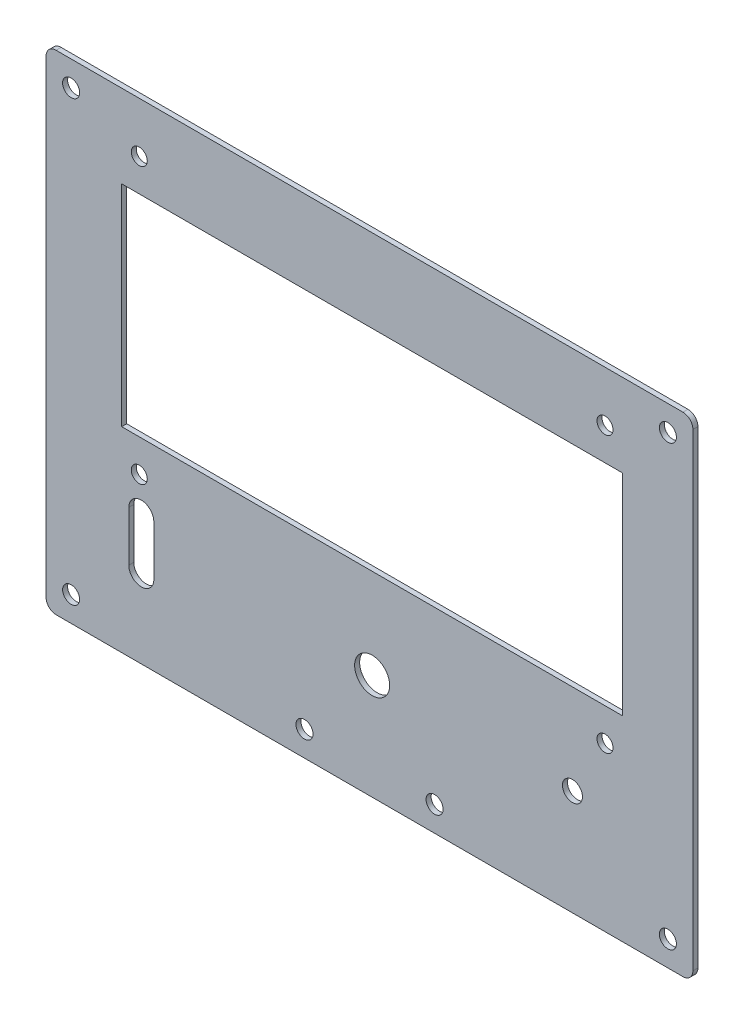
ISO-10303-21;
HEADER;
FILE_DESCRIPTION(('STEP AP214'),'2;1');
FILE_NAME('part.step','',(''),(''),'','','');
FILE_SCHEMA(('AUTOMOTIVE_DESIGN { 1 0 10303 214 1 1 1 1 }'));
ENDSEC;
DATA;
#1=APPLICATION_CONTEXT('core data for automotive mechanical design processes');
#2=APPLICATION_PROTOCOL_DEFINITION('international standard','automotive_design',2000,#1);
#3=PRODUCT_CONTEXT('',#1,'mechanical');
#4=PRODUCT('Part','Part','',(#3));
#5=PRODUCT_RELATED_PRODUCT_CATEGORY('part','',(#4));
#6=PRODUCT_DEFINITION_FORMATION('','',#4);
#7=PRODUCT_DEFINITION_CONTEXT('part definition',#1,'design');
#8=PRODUCT_DEFINITION('design','',#6,#7);
#9=PRODUCT_DEFINITION_SHAPE('','',#8);
#10=(LENGTH_UNIT() NAMED_UNIT(*) SI_UNIT(.MILLI.,.METRE.));
#11=(NAMED_UNIT(*) PLANE_ANGLE_UNIT() SI_UNIT($,.RADIAN.));
#12=(NAMED_UNIT(*) SI_UNIT($,.STERADIAN.) SOLID_ANGLE_UNIT());
#13=UNCERTAINTY_MEASURE_WITH_UNIT(LENGTH_MEASURE(1.E-05),#10,'distance_accuracy_value','');
#14=(GEOMETRIC_REPRESENTATION_CONTEXT(3) GLOBAL_UNCERTAINTY_ASSIGNED_CONTEXT((#13)) GLOBAL_UNIT_ASSIGNED_CONTEXT((#10,
#11,#12)) REPRESENTATION_CONTEXT('',''));
#15=CARTESIAN_POINT('',(0.,0.,0.));
#16=DIRECTION('',(0.,0.,1.));
#17=DIRECTION('',(1.,0.,0.));
#18=AXIS2_PLACEMENT_3D('',#15,#16,#17);
#19=CARTESIAN_POINT('',(110.511379673733,-46.4569942181545,1.));
#20=DIRECTION('',(0.,0.,1.));
#21=DIRECTION('',(1.,0.,0.));
#22=AXIS2_PLACEMENT_3D('',#19,#20,#21);
#23=PLANE('',#22);
#24=CARTESIAN_POINT('',(-11.6516415889526,44.1631832448527,1.));
#25=DIRECTION('',(0.,0.,1.));
#26=DIRECTION('',(1.,0.,0.));
#27=AXIS2_PLACEMENT_3D('',#24,#25,#26);
#28=CIRCLE('',#27,1.69999999999999);
#29=CARTESIAN_POINT('',(-9.95164158895261,44.1631832448527,1.));
#30=VERTEX_POINT('',#29);
#31=EDGE_CURVE('E329',#30,#30,#28,.T.);
#32=ORIENTED_EDGE('',*,*,#31,.F.);
#33=EDGE_LOOP('',(#32));
#34=FACE_BOUND('',#33,.T.);
#35=CARTESIAN_POINT('',(-11.6516415889526,-43.4569942181545,1.));
#36=DIRECTION('',(0.,0.,1.));
#37=DIRECTION('',(1.,0.,0.));
#38=AXIS2_PLACEMENT_3D('',#35,#36,#37);
#39=CIRCLE('',#38,1.69999999999999);
#40=CARTESIAN_POINT('',(-9.95164158895262,-43.4569942181545,1.));
#41=VERTEX_POINT('',#40);
#42=EDGE_CURVE('E319',#41,#41,#39,.T.);
#43=ORIENTED_EDGE('',*,*,#42,.F.);
#44=EDGE_LOOP('',(#43));
#45=FACE_BOUND('',#44,.T.);
#46=CARTESIAN_POINT('',(107.511379673732,-43.4569942181545,1.));
#47=DIRECTION('',(0.,0.,1.));
#48=DIRECTION('',(1.,0.,0.));
#49=AXIS2_PLACEMENT_3D('',#46,#47,#48);
#50=CIRCLE('',#49,1.69999999999999);
#51=CARTESIAN_POINT('',(109.211379673732,-43.4569942181545,1.));
#52=VERTEX_POINT('',#51);
#53=EDGE_CURVE('E316',#52,#52,#50,.T.);
#54=ORIENTED_EDGE('',*,*,#53,.F.);
#55=EDGE_LOOP('',(#54));
#56=FACE_BOUND('',#55,.T.);
#57=CARTESIAN_POINT('',(107.511379673732,44.1631832448527,1.));
#58=DIRECTION('',(0.,0.,1.));
#59=DIRECTION('',(1.,0.,0.));
#60=AXIS2_PLACEMENT_3D('',#57,#58,#59);
#61=CIRCLE('',#60,1.69999999999999);
#62=CARTESIAN_POINT('',(109.211379673732,44.1631832448527,1.));
#63=VERTEX_POINT('',#62);
#64=EDGE_CURVE('E313',#63,#63,#61,.T.);
#65=ORIENTED_EDGE('',*,*,#64,.F.);
#66=EDGE_LOOP('',(#65));
#67=FACE_BOUND('',#66,.T.);
#68=CARTESIAN_POINT('',(34.9492512988797,-43.4569942181544,1.));
#69=DIRECTION('',(0.,0.,1.));
#70=DIRECTION('',(1.,0.,0.));
#71=AXIS2_PLACEMENT_3D('',#68,#69,#70);
#72=CIRCLE('',#71,1.69999999999999);
#73=CARTESIAN_POINT('',(36.6492512988797,-43.4569942181544,1.));
#74=VERTEX_POINT('',#73);
#75=EDGE_CURVE('E309',#74,#74,#72,.T.);
#76=ORIENTED_EDGE('',*,*,#75,.F.);
#77=EDGE_LOOP('',(#76));
#78=FACE_BOUND('',#77,.T.);
#79=CARTESIAN_POINT('',(60.9298690423899,-43.4569942181545,1.));
#80=DIRECTION('',(0.,0.,1.));
#81=DIRECTION('',(1.,0.,0.));
#82=AXIS2_PLACEMENT_3D('',#79,#80,#81);
#83=CIRCLE('',#82,1.69999999999999);
#84=CARTESIAN_POINT('',(62.6298690423899,-43.4569942181545,1.));
#85=VERTEX_POINT('',#84);
#86=EDGE_CURVE('E308',#85,#85,#83,.T.);
#87=ORIENTED_EDGE('',*,*,#86,.F.);
#88=EDGE_LOOP('',(#87));
#89=FACE_BOUND('',#88,.T.);
#90=CARTESIAN_POINT('',(48.4577426044266,-27.384884030655,1.));
#91=DIRECTION('',(0.,0.,1.));
#92=DIRECTION('',(1.,0.,0.));
#93=AXIS2_PLACEMENT_3D('',#90,#91,#92);
#94=CIRCLE('',#93,3.5);
#95=CARTESIAN_POINT('',(51.9577426044266,-27.384884030655,1.));
#96=VERTEX_POINT('',#95);
#97=EDGE_CURVE('E222',#96,#96,#94,.T.);
#98=ORIENTED_EDGE('',*,*,#97,.F.);
#99=EDGE_LOOP('',(#98));
#100=FACE_BOUND('',#99,.T.);
#101=CARTESIAN_POINT('',(94.9614389126352,39.1204020875359,1.));
#102=DIRECTION('',(0.,0.,1.));
#103=DIRECTION('',(1.,0.,0.));
#104=AXIS2_PLACEMENT_3D('',#101,#102,#103);
#105=CIRCLE('',#104,1.60012718479857);
#106=CARTESIAN_POINT('',(96.5615660974338,39.1204020875359,1.));
#107=VERTEX_POINT('',#106);
#108=EDGE_CURVE('E234',#107,#107,#105,.T.);
#109=ORIENTED_EDGE('',*,*,#108,.F.);
#110=EDGE_LOOP('',(#109));
#111=FACE_BOUND('',#110,.T.);
#112=CARTESIAN_POINT('',(1.95404629621795,-15.8839698899152,1.));
#113=DIRECTION('',(0.,0.,1.));
#114=DIRECTION('',(1.,0.,0.));
#115=AXIS2_PLACEMENT_3D('',#112,#113,#114);
#116=CIRCLE('',#115,1.60012718479858);
#117=CARTESIAN_POINT('',(3.55417348101653,-15.8839698899152,1.));
#118=VERTEX_POINT('',#117);
#119=EDGE_CURVE('E246',#118,#118,#116,.T.);
#120=ORIENTED_EDGE('',*,*,#119,.F.);
#121=EDGE_LOOP('',(#120));
#122=FACE_BOUND('',#121,.T.);
#123=CARTESIAN_POINT('',(110.511379673733,-46.4569942181545,1.));
#124=DIRECTION('',(0.,0.,1.));
#125=DIRECTION('',(1.,0.,0.));
#126=AXIS2_PLACEMENT_3D('',#123,#124,#125);
#127=CIRCLE('',#126,1.99999999999999);
#128=CARTESIAN_POINT('',(110.511379673733,-48.4569942181545,1.));
#129=VERTEX_POINT('',#128);
#130=CARTESIAN_POINT('',(112.511379673732,-46.4569942181545,1.));
#131=VERTEX_POINT('',#130);
#132=EDGE_CURVE('E252',#129,#131,#127,.T.);
#133=ORIENTED_EDGE('',*,*,#132,.T.);
#134=DIRECTION('',(0.,1.,0.));
#135=VECTOR('',#134,1.);
#136=CARTESIAN_POINT('',(112.511379673732,47.1631832448527,1.));
#137=LINE('',#136,#135);
#138=CARTESIAN_POINT('',(112.511379673732,47.1631832448527,1.));
#139=VERTEX_POINT('',#138);
#140=EDGE_CURVE('E255',#131,#139,#137,.T.);
#141=ORIENTED_EDGE('',*,*,#140,.T.);
#142=CARTESIAN_POINT('',(110.511379673732,47.1631832448527,1.));
#143=DIRECTION('',(0.,0.,1.));
#144=DIRECTION('',(-1.,0.,0.));
#145=AXIS2_PLACEMENT_3D('',#142,#143,#144);
#146=CIRCLE('',#145,1.99999999999999);
#147=CARTESIAN_POINT('',(110.511379673732,49.1631832448527,1.));
#148=VERTEX_POINT('',#147);
#149=EDGE_CURVE('E258',#139,#148,#146,.T.);
#150=ORIENTED_EDGE('',*,*,#149,.T.);
#151=DIRECTION('',(-1.,0.,0.));
#152=VECTOR('',#151,1.);
#153=CARTESIAN_POINT('',(-14.6516415889526,49.1631832448527,1.));
#154=LINE('',#153,#152);
#155=CARTESIAN_POINT('',(-14.6516415889526,49.1631832448527,1.));
#156=VERTEX_POINT('',#155);
#157=EDGE_CURVE('E260',#148,#156,#154,.T.);
#158=ORIENTED_EDGE('',*,*,#157,.T.);
#159=CARTESIAN_POINT('',(-14.6516415889526,47.1631832448527,1.));
#160=DIRECTION('',(0.,0.,1.));
#161=DIRECTION('',(1.,0.,0.));
#162=AXIS2_PLACEMENT_3D('',#159,#160,#161);
#163=CIRCLE('',#162,2.);
#164=CARTESIAN_POINT('',(-16.6516415889526,47.1631832448527,1.));
#165=VERTEX_POINT('',#164);
#166=EDGE_CURVE('E262',#156,#165,#163,.T.);
#167=ORIENTED_EDGE('',*,*,#166,.T.);
#168=DIRECTION('',(0.,-1.,0.));
#169=VECTOR('',#168,1.);
#170=CARTESIAN_POINT('',(-16.6516415889526,47.1631832448527,1.));
#171=LINE('',#170,#169);
#172=CARTESIAN_POINT('',(-16.6516415889526,-46.4569942181545,1.));
#173=VERTEX_POINT('',#172);
#174=EDGE_CURVE('E264',#165,#173,#171,.T.);
#175=ORIENTED_EDGE('',*,*,#174,.T.);
#176=CARTESIAN_POINT('',(-14.6516415889526,-46.4569942181545,1.));
#177=DIRECTION('',(0.,0.,1.));
#178=DIRECTION('',(1.,0.,0.));
#179=AXIS2_PLACEMENT_3D('',#176,#177,#178);
#180=CIRCLE('',#179,2.);
#181=CARTESIAN_POINT('',(-14.6516415889526,-48.4569942181545,1.));
#182=VERTEX_POINT('',#181);
#183=EDGE_CURVE('E266',#173,#182,#180,.T.);
#184=ORIENTED_EDGE('',*,*,#183,.T.);
#185=DIRECTION('',(1.,0.,0.));
#186=VECTOR('',#185,1.);
#187=CARTESIAN_POINT('',(-14.6516415889526,-48.4569942181545,1.));
#188=LINE('',#187,#186);
#189=EDGE_CURVE('E268',#182,#129,#188,.T.);
#190=ORIENTED_EDGE('',*,*,#189,.T.);
#191=EDGE_LOOP('',(#133,#141,#150,#158,#167,#175,#184,#190));
#192=FACE_BOUND('',#191,.T.);
#193=CARTESIAN_POINT('',(1.95404629621795,39.1204020875359,1.));
#194=DIRECTION('',(0.,0.,1.));
#195=DIRECTION('',(1.,0.,0.));
#196=AXIS2_PLACEMENT_3D('',#193,#194,#195);
#197=CIRCLE('',#196,1.60012718479858);
#198=CARTESIAN_POINT('',(3.55417348101653,39.1204020875359,1.));
#199=VERTEX_POINT('',#198);
#200=EDGE_CURVE('E240',#199,#199,#197,.T.);
#201=ORIENTED_EDGE('',*,*,#200,.F.);
#202=EDGE_LOOP('',(#201));
#203=FACE_BOUND('',#202,.T.);
#204=CARTESIAN_POINT('',(94.9614389126352,-15.8839698899152,1.));
#205=DIRECTION('',(0.,0.,1.));
#206=DIRECTION('',(1.,0.,0.));
#207=AXIS2_PLACEMENT_3D('',#204,#205,#206);
#208=CIRCLE('',#207,1.60012718479857);
#209=CARTESIAN_POINT('',(96.5615660974338,-15.8839698899152,1.));
#210=VERTEX_POINT('',#209);
#211=EDGE_CURVE('E228',#210,#210,#208,.T.);
#212=ORIENTED_EDGE('',*,*,#211,.F.);
#213=EDGE_LOOP('',(#212));
#214=FACE_BOUND('',#213,.T.);
#215=CARTESIAN_POINT('',(88.460922224391,-27.384884030655,1.));
#216=DIRECTION('',(0.,0.,1.));
#217=DIRECTION('',(1.,0.,0.));
#218=AXIS2_PLACEMENT_3D('',#215,#216,#217);
#219=CIRCLE('',#218,2.);
#220=CARTESIAN_POINT('',(90.460922224391,-27.384884030655,1.));
#221=VERTEX_POINT('',#220);
#222=EDGE_CURVE('E216',#221,#221,#219,.T.);
#223=ORIENTED_EDGE('',*,*,#222,.F.);
#224=EDGE_LOOP('',(#223));
#225=FACE_BOUND('',#224,.T.);
#226=DIRECTION('',(0.,1.,0.));
#227=VECTOR('',#226,1.);
#228=CARTESIAN_POINT('',(4.86440845486467,-32.6276637045219,1.));
#229=LINE('',#228,#227);
#230=CARTESIAN_POINT('',(4.86440845486467,-32.6276637045219,1.));
#231=VERTEX_POINT('',#230);
#232=CARTESIAN_POINT('',(4.86440845486467,-22.6276637045219,1.));
#233=VERTEX_POINT('',#232);
#234=EDGE_CURVE('E187',#231,#233,#229,.T.);
#235=ORIENTED_EDGE('',*,*,#234,.F.);
#236=CARTESIAN_POINT('',(2.36440845486467,-32.6276637045219,1.));
#237=DIRECTION('',(0.,0.,1.));
#238=DIRECTION('',(1.,0.,0.));
#239=AXIS2_PLACEMENT_3D('',#236,#237,#238);
#240=CIRCLE('',#239,2.5);
#241=CARTESIAN_POINT('',(-0.135591545135326,-32.6276637045219,1.));
#242=VERTEX_POINT('',#241);
#243=EDGE_CURVE('E185',#242,#231,#240,.T.);
#244=ORIENTED_EDGE('',*,*,#243,.F.);
#245=DIRECTION('',(0.,-1.,0.));
#246=VECTOR('',#245,1.);
#247=CARTESIAN_POINT('',(-0.135591545135326,-32.6276637045219,1.));
#248=LINE('',#247,#246);
#249=CARTESIAN_POINT('',(-0.13559154513533,-22.6276637045219,1.));
#250=VERTEX_POINT('',#249);
#251=EDGE_CURVE('E193',#250,#242,#248,.T.);
#252=ORIENTED_EDGE('',*,*,#251,.F.);
#253=CARTESIAN_POINT('',(2.36440845486467,-22.6276637045219,1.));
#254=DIRECTION('',(0.,0.,1.));
#255=DIRECTION('',(1.,0.,0.));
#256=AXIS2_PLACEMENT_3D('',#253,#254,#255);
#257=CIRCLE('',#256,2.5);
#258=EDGE_CURVE('E190',#233,#250,#257,.T.);
#259=ORIENTED_EDGE('',*,*,#258,.F.);
#260=EDGE_LOOP('',(#235,#244,#252,#259));
#261=FACE_BOUND('',#260,.T.);
#262=DIRECTION('',(0.,1.,0.));
#263=VECTOR('',#262,1.);
#264=CARTESIAN_POINT('',(98.4540462962179,32.6204020875359,1.));
#265=LINE('',#264,#263);
#266=CARTESIAN_POINT('',(98.4540462962179,-9.37959791246413,1.));
#267=VERTEX_POINT('',#266);
#268=CARTESIAN_POINT('',(98.4540462962179,32.6204020875359,1.));
#269=VERTEX_POINT('',#268);
#270=EDGE_CURVE('E155',#267,#269,#265,.T.);
#271=ORIENTED_EDGE('',*,*,#270,.F.);
#272=DIRECTION('',(1.,0.,0.));
#273=VECTOR('',#272,1.);
#274=CARTESIAN_POINT('',(98.4540462962179,-9.37959791246413,1.));
#275=LINE('',#274,#273);
#276=CARTESIAN_POINT('',(-1.54595370378205,-9.37959791246413,1.));
#277=VERTEX_POINT('',#276);
#278=EDGE_CURVE('E147',#277,#267,#275,.T.);
#279=ORIENTED_EDGE('',*,*,#278,.F.);
#280=DIRECTION('',(0.,-1.,0.));
#281=VECTOR('',#280,1.);
#282=CARTESIAN_POINT('',(-1.54595370378205,-9.37959791246413,1.));
#283=LINE('',#282,#281);
#284=CARTESIAN_POINT('',(-1.54595370378205,32.6204020875359,1.));
#285=VERTEX_POINT('',#284);
#286=EDGE_CURVE('E169',#285,#277,#283,.T.);
#287=ORIENTED_EDGE('',*,*,#286,.F.);
#288=DIRECTION('',(-1.,0.,0.));
#289=VECTOR('',#288,1.);
#290=CARTESIAN_POINT('',(-1.54595370378205,32.6204020875359,1.));
#291=LINE('',#290,#289);
#292=EDGE_CURVE('E167',#269,#285,#291,.T.);
#293=ORIENTED_EDGE('',*,*,#292,.F.);
#294=EDGE_LOOP('',(#271,#279,#287,#293));
#295=FACE_BOUND('',#294,.T.);
#296=ADVANCED_FACE('F32',(#34,#45,#56,#67,#78,#89,#100,#111,#122,#192,#203,#214,#225,#261,#295),
#23,.T.);
#297=CARTESIAN_POINT('',(110.511379673733,-46.4569942181545,0.));
#298=DIRECTION('',(0.,0.,1.));
#299=DIRECTION('',(1.,0.,0.));
#300=AXIS2_PLACEMENT_3D('',#297,#298,#299);
#301=PLANE('',#300);
#302=CARTESIAN_POINT('',(-11.6516415889526,44.1631832448527,0.));
#303=DIRECTION('',(0.,0.,1.));
#304=DIRECTION('',(1.,0.,0.));
#305=AXIS2_PLACEMENT_3D('',#302,#303,#304);
#306=CIRCLE('',#305,1.69999999999999);
#307=CARTESIAN_POINT('',(-9.95164158895261,44.1631832448527,0.));
#308=VERTEX_POINT('',#307);
#309=EDGE_CURVE('E36',#308,#308,#306,.T.);
#310=ORIENTED_EDGE('',*,*,#309,.T.);
#311=EDGE_LOOP('',(#310));
#312=FACE_BOUND('',#311,.T.);
#313=CARTESIAN_POINT('',(-11.6516415889526,-43.4569942181545,0.));
#314=DIRECTION('',(0.,0.,1.));
#315=DIRECTION('',(1.,0.,0.));
#316=AXIS2_PLACEMENT_3D('',#313,#314,#315);
#317=CIRCLE('',#316,1.69999999999999);
#318=CARTESIAN_POINT('',(-9.95164158895262,-43.4569942181545,0.));
#319=VERTEX_POINT('',#318);
#320=EDGE_CURVE('E317',#319,#319,#317,.T.);
#321=ORIENTED_EDGE('',*,*,#320,.T.);
#322=EDGE_LOOP('',(#321));
#323=FACE_BOUND('',#322,.T.);
#324=CARTESIAN_POINT('',(107.511379673732,-43.4569942181545,0.));
#325=DIRECTION('',(0.,0.,1.));
#326=DIRECTION('',(1.,0.,0.));
#327=AXIS2_PLACEMENT_3D('',#324,#325,#326);
#328=CIRCLE('',#327,1.69999999999999);
#329=CARTESIAN_POINT('',(109.211379673732,-43.4569942181545,0.));
#330=VERTEX_POINT('',#329);
#331=EDGE_CURVE('E314',#330,#330,#328,.T.);
#332=ORIENTED_EDGE('',*,*,#331,.T.);
#333=EDGE_LOOP('',(#332));
#334=FACE_BOUND('',#333,.T.);
#335=CARTESIAN_POINT('',(107.511379673732,44.1631832448527,0.));
#336=DIRECTION('',(0.,0.,1.));
#337=DIRECTION('',(1.,0.,0.));
#338=AXIS2_PLACEMENT_3D('',#335,#336,#337);
#339=CIRCLE('',#338,1.69999999999999);
#340=CARTESIAN_POINT('',(109.211379673732,44.1631832448527,0.));
#341=VERTEX_POINT('',#340);
#342=EDGE_CURVE('E310',#341,#341,#339,.T.);
#343=ORIENTED_EDGE('',*,*,#342,.T.);
#344=EDGE_LOOP('',(#343));
#345=FACE_BOUND('',#344,.T.);
#346=CARTESIAN_POINT('',(34.9492512988797,-43.4569942181544,0.));
#347=DIRECTION('',(0.,0.,1.));
#348=DIRECTION('',(1.,0.,0.));
#349=AXIS2_PLACEMENT_3D('',#346,#347,#348);
#350=CIRCLE('',#349,1.69999999999999);
#351=CARTESIAN_POINT('',(36.6492512988797,-43.4569942181544,0.));
#352=VERTEX_POINT('',#351);
#353=EDGE_CURVE('E305',#352,#352,#350,.T.);
#354=ORIENTED_EDGE('',*,*,#353,.T.);
#355=EDGE_LOOP('',(#354));
#356=FACE_BOUND('',#355,.T.);
#357=CARTESIAN_POINT('',(60.9298690423899,-43.4569942181545,0.));
#358=DIRECTION('',(0.,0.,1.));
#359=DIRECTION('',(1.,0.,0.));
#360=AXIS2_PLACEMENT_3D('',#357,#358,#359);
#361=CIRCLE('',#360,1.69999999999999);
#362=CARTESIAN_POINT('',(62.6298690423899,-43.4569942181545,0.));
#363=VERTEX_POINT('',#362);
#364=EDGE_CURVE('E175',#363,#363,#361,.T.);
#365=ORIENTED_EDGE('',*,*,#364,.T.);
#366=EDGE_LOOP('',(#365));
#367=FACE_BOUND('',#366,.T.);
#368=CARTESIAN_POINT('',(2.36440845486467,-32.6276637045219,0.));
#369=DIRECTION('',(0.,0.,1.));
#370=DIRECTION('',(1.,0.,0.));
#371=AXIS2_PLACEMENT_3D('',#368,#369,#370);
#372=CIRCLE('',#371,2.5);
#373=CARTESIAN_POINT('',(-0.13559154513533,-32.6276637045219,0.));
#374=VERTEX_POINT('',#373);
#375=CARTESIAN_POINT('',(4.86440845486467,-32.6276637045219,0.));
#376=VERTEX_POINT('',#375);
#377=EDGE_CURVE('E163',#374,#376,#372,.T.);
#378=ORIENTED_EDGE('',*,*,#377,.T.);
#379=DIRECTION('',(0.,1.,0.));
#380=VECTOR('',#379,1.);
#381=CARTESIAN_POINT('',(4.86440845486467,-32.6276637045219,0.));
#382=LINE('',#381,#380);
#383=CARTESIAN_POINT('',(4.86440845486467,-22.6276637045219,0.));
#384=VERTEX_POINT('',#383);
#385=EDGE_CURVE('E198',#376,#384,#382,.T.);
#386=ORIENTED_EDGE('',*,*,#385,.T.);
#387=CARTESIAN_POINT('',(2.36440845486467,-22.6276637045219,0.));
#388=DIRECTION('',(0.,0.,1.));
#389=DIRECTION('',(1.,0.,0.));
#390=AXIS2_PLACEMENT_3D('',#387,#388,#389);
#391=CIRCLE('',#390,2.5);
#392=CARTESIAN_POINT('',(-0.135591545135326,-22.6276637045219,0.));
#393=VERTEX_POINT('',#392);
#394=EDGE_CURVE('E201',#384,#393,#391,.T.);
#395=ORIENTED_EDGE('',*,*,#394,.T.);
#396=DIRECTION('',(0.,-1.,0.));
#397=VECTOR('',#396,1.);
#398=CARTESIAN_POINT('',(-0.135591545135326,-32.6276637045219,0.));
#399=LINE('',#398,#397);
#400=EDGE_CURVE('E188',#393,#374,#399,.T.);
#401=ORIENTED_EDGE('',*,*,#400,.T.);
#402=EDGE_LOOP('',(#378,#386,#395,#401));
#403=FACE_BOUND('',#402,.T.);
#404=CARTESIAN_POINT('',(110.511379673733,-46.4569942181545,0.));
#405=DIRECTION('',(0.,0.,1.));
#406=DIRECTION('',(1.,0.,0.));
#407=AXIS2_PLACEMENT_3D('',#404,#405,#406);
#408=CIRCLE('',#407,1.99999999999999);
#409=CARTESIAN_POINT('',(110.511379673733,-48.4569942181545,0.));
#410=VERTEX_POINT('',#409);
#411=CARTESIAN_POINT('',(112.511379673732,-46.4569942181545,0.));
#412=VERTEX_POINT('',#411);
#413=EDGE_CURVE('E249',#410,#412,#408,.T.);
#414=ORIENTED_EDGE('',*,*,#413,.F.);
#415=DIRECTION('',(1.,0.,0.));
#416=VECTOR('',#415,1.);
#417=CARTESIAN_POINT('',(-14.6516415889526,-48.4569942181545,0.));
#418=LINE('',#417,#416);
#419=CARTESIAN_POINT('',(-14.6516415889526,-48.4569942181545,0.));
#420=VERTEX_POINT('',#419);
#421=EDGE_CURVE('E256',#420,#410,#418,.T.);
#422=ORIENTED_EDGE('',*,*,#421,.F.);
#423=CARTESIAN_POINT('',(-14.6516415889526,-46.4569942181545,0.));
#424=DIRECTION('',(0.,0.,1.));
#425=DIRECTION('',(1.,0.,0.));
#426=AXIS2_PLACEMENT_3D('',#423,#424,#425);
#427=CIRCLE('',#426,2.);
#428=CARTESIAN_POINT('',(-16.6516415889526,-46.4569942181545,0.));
#429=VERTEX_POINT('',#428);
#430=EDGE_CURVE('E283',#429,#420,#427,.T.);
#431=ORIENTED_EDGE('',*,*,#430,.F.);
#432=DIRECTION('',(0.,-1.,0.));
#433=VECTOR('',#432,1.);
#434=CARTESIAN_POINT('',(-16.6516415889526,47.1631832448527,0.));
#435=LINE('',#434,#433);
#436=CARTESIAN_POINT('',(-16.6516415889526,47.1631832448527,0.));
#437=VERTEX_POINT('',#436);
#438=EDGE_CURVE('E281',#437,#429,#435,.T.);
#439=ORIENTED_EDGE('',*,*,#438,.F.);
#440=CARTESIAN_POINT('',(-14.6516415889526,47.1631832448527,0.));
#441=DIRECTION('',(0.,0.,1.));
#442=DIRECTION('',(1.,0.,0.));
#443=AXIS2_PLACEMENT_3D('',#440,#441,#442);
#444=CIRCLE('',#443,2.);
#445=CARTESIAN_POINT('',(-14.6516415889526,49.1631832448527,0.));
#446=VERTEX_POINT('',#445);
#447=EDGE_CURVE('E279',#446,#437,#444,.T.);
#448=ORIENTED_EDGE('',*,*,#447,.F.);
#449=DIRECTION('',(-1.,0.,0.));
#450=VECTOR('',#449,1.);
#451=CARTESIAN_POINT('',(-14.6516415889526,49.1631832448527,0.));
#452=LINE('',#451,#450);
#453=CARTESIAN_POINT('',(110.511379673732,49.1631832448527,0.));
#454=VERTEX_POINT('',#453);
#455=EDGE_CURVE('E277',#454,#446,#452,.T.);
#456=ORIENTED_EDGE('',*,*,#455,.F.);
#457=CARTESIAN_POINT('',(110.511379673732,47.1631832448527,0.));
#458=DIRECTION('',(0.,0.,1.));
#459=DIRECTION('',(-1.,0.,0.));
#460=AXIS2_PLACEMENT_3D('',#457,#458,#459);
#461=CIRCLE('',#460,1.99999999999999);
#462=CARTESIAN_POINT('',(112.511379673732,47.1631832448527,0.));
#463=VERTEX_POINT('',#462);
#464=EDGE_CURVE('E275',#463,#454,#461,.T.);
#465=ORIENTED_EDGE('',*,*,#464,.F.);
#466=DIRECTION('',(0.,1.,0.));
#467=VECTOR('',#466,1.);
#468=CARTESIAN_POINT('',(112.511379673732,47.1631832448527,0.));
#469=LINE('',#468,#467);
#470=EDGE_CURVE('E273',#412,#463,#469,.T.);
#471=ORIENTED_EDGE('',*,*,#470,.F.);
#472=EDGE_LOOP('',(#414,#422,#431,#439,#448,#456,#465,#471));
#473=FACE_BOUND('',#472,.T.);
#474=CARTESIAN_POINT('',(1.95404629621795,-15.8839698899152,0.));
#475=DIRECTION('',(0.,0.,1.));
#476=DIRECTION('',(1.,0.,0.));
#477=AXIS2_PLACEMENT_3D('',#474,#475,#476);
#478=CIRCLE('',#477,1.60012718479858);
#479=CARTESIAN_POINT('',(3.55417348101653,-15.8839698899152,0.));
#480=VERTEX_POINT('',#479);
#481=EDGE_CURVE('E243',#480,#480,#478,.T.);
#482=ORIENTED_EDGE('',*,*,#481,.T.);
#483=EDGE_LOOP('',(#482));
#484=FACE_BOUND('',#483,.T.);
#485=CARTESIAN_POINT('',(1.95404629621795,39.1204020875359,0.));
#486=DIRECTION('',(0.,0.,1.));
#487=DIRECTION('',(1.,0.,0.));
#488=AXIS2_PLACEMENT_3D('',#485,#486,#487);
#489=CIRCLE('',#488,1.60012718479858);
#490=CARTESIAN_POINT('',(3.55417348101653,39.1204020875359,0.));
#491=VERTEX_POINT('',#490);
#492=EDGE_CURVE('E237',#491,#491,#489,.T.);
#493=ORIENTED_EDGE('',*,*,#492,.T.);
#494=EDGE_LOOP('',(#493));
#495=FACE_BOUND('',#494,.T.);
#496=CARTESIAN_POINT('',(94.9614389126352,39.1204020875359,0.));
#497=DIRECTION('',(0.,0.,1.));
#498=DIRECTION('',(1.,0.,0.));
#499=AXIS2_PLACEMENT_3D('',#496,#497,#498);
#500=CIRCLE('',#499,1.60012718479857);
#501=CARTESIAN_POINT('',(96.5615660974338,39.1204020875359,0.));
#502=VERTEX_POINT('',#501);
#503=EDGE_CURVE('E231',#502,#502,#500,.T.);
#504=ORIENTED_EDGE('',*,*,#503,.T.);
#505=EDGE_LOOP('',(#504));
#506=FACE_BOUND('',#505,.T.);
#507=CARTESIAN_POINT('',(94.9614389126352,-15.8839698899152,0.));
#508=DIRECTION('',(0.,0.,1.));
#509=DIRECTION('',(1.,0.,0.));
#510=AXIS2_PLACEMENT_3D('',#507,#508,#509);
#511=CIRCLE('',#510,1.60012718479857);
#512=CARTESIAN_POINT('',(96.5615660974338,-15.8839698899152,0.));
#513=VERTEX_POINT('',#512);
#514=EDGE_CURVE('E225',#513,#513,#511,.T.);
#515=ORIENTED_EDGE('',*,*,#514,.T.);
#516=EDGE_LOOP('',(#515));
#517=FACE_BOUND('',#516,.T.);
#518=CARTESIAN_POINT('',(48.4577426044266,-27.384884030655,0.));
#519=DIRECTION('',(0.,0.,1.));
#520=DIRECTION('',(1.,0.,0.));
#521=AXIS2_PLACEMENT_3D('',#518,#519,#520);
#522=CIRCLE('',#521,3.5);
#523=CARTESIAN_POINT('',(51.9577426044266,-27.384884030655,0.));
#524=VERTEX_POINT('',#523);
#525=EDGE_CURVE('E219',#524,#524,#522,.T.);
#526=ORIENTED_EDGE('',*,*,#525,.T.);
#527=EDGE_LOOP('',(#526));
#528=FACE_BOUND('',#527,.T.);
#529=CARTESIAN_POINT('',(88.460922224391,-27.384884030655,0.));
#530=DIRECTION('',(0.,0.,1.));
#531=DIRECTION('',(1.,0.,0.));
#532=AXIS2_PLACEMENT_3D('',#529,#530,#531);
#533=CIRCLE('',#532,2.);
#534=CARTESIAN_POINT('',(90.460922224391,-27.384884030655,0.));
#535=VERTEX_POINT('',#534);
#536=EDGE_CURVE('E215',#535,#535,#533,.T.);
#537=ORIENTED_EDGE('',*,*,#536,.T.);
#538=EDGE_LOOP('',(#537));
#539=FACE_BOUND('',#538,.T.);
#540=DIRECTION('',(1.,0.,0.));
#541=VECTOR('',#540,1.);
#542=CARTESIAN_POINT('',(98.4540462962179,-9.37959791246413,0.));
#543=LINE('',#542,#541);
#544=CARTESIAN_POINT('',(-1.54595370378205,-9.37959791246413,0.));
#545=VERTEX_POINT('',#544);
#546=CARTESIAN_POINT('',(98.4540462962179,-9.37959791246413,0.));
#547=VERTEX_POINT('',#546);
#548=EDGE_CURVE('E57',#545,#547,#543,.T.);
#549=ORIENTED_EDGE('',*,*,#548,.T.);
#550=DIRECTION('',(0.,1.,0.));
#551=VECTOR('',#550,1.);
#552=CARTESIAN_POINT('',(98.4540462962179,32.6204020875359,0.));
#553=LINE('',#552,#551);
#554=CARTESIAN_POINT('',(98.4540462962179,32.6204020875359,0.));
#555=VERTEX_POINT('',#554);
#556=EDGE_CURVE('E162',#547,#555,#553,.T.);
#557=ORIENTED_EDGE('',*,*,#556,.T.);
#558=DIRECTION('',(-1.,0.,0.));
#559=VECTOR('',#558,1.);
#560=CARTESIAN_POINT('',(-1.54595370378205,32.6204020875359,0.));
#561=LINE('',#560,#559);
#562=CARTESIAN_POINT('',(-1.54595370378205,32.6204020875359,0.));
#563=VERTEX_POINT('',#562);
#564=EDGE_CURVE('E177',#555,#563,#561,.T.);
#565=ORIENTED_EDGE('',*,*,#564,.T.);
#566=DIRECTION('',(0.,-1.,0.));
#567=VECTOR('',#566,1.);
#568=CARTESIAN_POINT('',(-1.54595370378205,-9.37959791246413,0.));
#569=LINE('',#568,#567);
#570=EDGE_CURVE('E156',#563,#545,#569,.T.);
#571=ORIENTED_EDGE('',*,*,#570,.T.);
#572=EDGE_LOOP('',(#549,#557,#565,#571));
#573=FACE_BOUND('',#572,.T.);
#574=ADVANCED_FACE('F340',(#312,#323,#334,#345,#356,#367,#403,#473,#484,#495,#506,#517,#528,
#539,#573),#301,.F.);
#575=CARTESIAN_POINT('',(110.511379673733,-46.4569942181545,1.));
#576=DIRECTION('',(0.,0.,-1.));
#577=DIRECTION('',(-1.,0.,0.));
#578=AXIS2_PLACEMENT_3D('',#575,#576,#577);
#579=CYLINDRICAL_SURFACE('',#578,1.99999999999999);
#580=ORIENTED_EDGE('',*,*,#413,.T.);
#581=DIRECTION('',(0.,0.,-1.));
#582=VECTOR('',#581,1.);
#583=CARTESIAN_POINT('',(112.511379673732,-46.4569942181545,1.));
#584=LINE('',#583,#582);
#585=EDGE_CURVE('E11',#131,#412,#584,.T.);
#586=ORIENTED_EDGE('',*,*,#585,.F.);
#587=ORIENTED_EDGE('',*,*,#132,.F.);
#588=DIRECTION('',(0.,0.,-1.));
#589=VECTOR('',#588,1.);
#590=CARTESIAN_POINT('',(110.511379673733,-48.4569942181545,1.));
#591=LINE('',#590,#589);
#592=EDGE_CURVE('E270',#129,#410,#591,.T.);
#593=ORIENTED_EDGE('',*,*,#592,.T.);
#594=EDGE_LOOP('',(#580,#586,#587,#593));
#595=FACE_BOUND('',#594,.T.);
#596=ADVANCED_FACE('F34',(#595),#579,.T.);
#597=CARTESIAN_POINT('',(112.511379673732,47.1631832448527,1.));
#598=DIRECTION('',(-1.,0.,0.));
#599=DIRECTION('',(0.,-1.,0.));
#600=AXIS2_PLACEMENT_3D('',#597,#598,#599);
#601=PLANE('',#600);
#602=ORIENTED_EDGE('',*,*,#470,.T.);
#603=DIRECTION('',(0.,0.,-1.));
#604=VECTOR('',#603,1.);
#605=CARTESIAN_POINT('',(112.511379673732,47.1631832448527,1.));
#606=LINE('',#605,#604);
#607=EDGE_CURVE('E41',#139,#463,#606,.T.);
#608=ORIENTED_EDGE('',*,*,#607,.F.);
#609=ORIENTED_EDGE('',*,*,#140,.F.);
#610=ORIENTED_EDGE('',*,*,#585,.T.);
#611=EDGE_LOOP('',(#602,#608,#609,#610));
#612=FACE_BOUND('',#611,.T.);
#613=ADVANCED_FACE('F394',(#612),#601,.F.);
#614=CARTESIAN_POINT('',(110.511379673732,47.1631832448527,1.));
#615=DIRECTION('',(0.,0.,-1.));
#616=DIRECTION('',(-1.,0.,0.));
#617=AXIS2_PLACEMENT_3D('',#614,#615,#616);
#618=CYLINDRICAL_SURFACE('',#617,1.99999999999999);
#619=ORIENTED_EDGE('',*,*,#464,.T.);
#620=DIRECTION('',(0.,0.,-1.));
#621=VECTOR('',#620,1.);
#622=CARTESIAN_POINT('',(110.511379673732,49.1631832448527,1.));
#623=LINE('',#622,#621);
#624=EDGE_CURVE('E300',#148,#454,#623,.T.);
#625=ORIENTED_EDGE('',*,*,#624,.F.);
#626=ORIENTED_EDGE('',*,*,#149,.F.);
#627=ORIENTED_EDGE('',*,*,#607,.T.);
#628=EDGE_LOOP('',(#619,#625,#626,#627));
#629=FACE_BOUND('',#628,.T.);
#630=ADVANCED_FACE('F391',(#629),#618,.T.);
#631=CARTESIAN_POINT('',(-14.6516415889526,49.1631832448527,1.));
#632=DIRECTION('',(0.,-1.,0.));
#633=DIRECTION('',(0.,0.,-1.));
#634=AXIS2_PLACEMENT_3D('',#631,#632,#633);
#635=PLANE('',#634);
#636=ORIENTED_EDGE('',*,*,#455,.T.);
#637=DIRECTION('',(0.,0.,-1.));
#638=VECTOR('',#637,1.);
#639=CARTESIAN_POINT('',(-14.6516415889526,49.1631832448527,1.));
#640=LINE('',#639,#638);
#641=EDGE_CURVE('E297',#156,#446,#640,.T.);
#642=ORIENTED_EDGE('',*,*,#641,.F.);
#643=ORIENTED_EDGE('',*,*,#157,.F.);
#644=ORIENTED_EDGE('',*,*,#624,.T.);
#645=EDGE_LOOP('',(#636,#642,#643,#644));
#646=FACE_BOUND('',#645,.T.);
#647=ADVANCED_FACE('F387',(#646),#635,.F.);
#648=CARTESIAN_POINT('',(-14.6516415889526,47.1631832448527,1.));
#649=DIRECTION('',(0.,0.,-1.));
#650=DIRECTION('',(-1.,0.,0.));
#651=AXIS2_PLACEMENT_3D('',#648,#649,#650);
#652=CYLINDRICAL_SURFACE('',#651,2.);
#653=ORIENTED_EDGE('',*,*,#447,.T.);
#654=DIRECTION('',(0.,0.,-1.));
#655=VECTOR('',#654,1.);
#656=CARTESIAN_POINT('',(-16.6516415889526,47.1631832448527,1.));
#657=LINE('',#656,#655);
#658=EDGE_CURVE('E294',#165,#437,#657,.T.);
#659=ORIENTED_EDGE('',*,*,#658,.F.);
#660=ORIENTED_EDGE('',*,*,#166,.F.);
#661=ORIENTED_EDGE('',*,*,#641,.T.);
#662=EDGE_LOOP('',(#653,#659,#660,#661));
#663=FACE_BOUND('',#662,.T.);
#664=ADVANCED_FACE('F383',(#663),#652,.T.);
#665=CARTESIAN_POINT('',(-16.6516415889526,47.1631832448527,1.));
#666=DIRECTION('',(1.,0.,0.));
#667=DIRECTION('',(0.,0.,-1.));
#668=AXIS2_PLACEMENT_3D('',#665,#666,#667);
#669=PLANE('',#668);
#670=ORIENTED_EDGE('',*,*,#438,.T.);
#671=DIRECTION('',(0.,0.,-1.));
#672=VECTOR('',#671,1.);
#673=CARTESIAN_POINT('',(-16.6516415889526,-46.4569942181545,1.));
#674=LINE('',#673,#672);
#675=EDGE_CURVE('E291',#173,#429,#674,.T.);
#676=ORIENTED_EDGE('',*,*,#675,.F.);
#677=ORIENTED_EDGE('',*,*,#174,.F.);
#678=ORIENTED_EDGE('',*,*,#658,.T.);
#679=EDGE_LOOP('',(#670,#676,#677,#678));
#680=FACE_BOUND('',#679,.T.);
#681=ADVANCED_FACE('F379',(#680),#669,.F.);
#682=CARTESIAN_POINT('',(-14.6516415889526,-46.4569942181545,1.));
#683=DIRECTION('',(0.,0.,-1.));
#684=DIRECTION('',(-1.,0.,0.));
#685=AXIS2_PLACEMENT_3D('',#682,#683,#684);
#686=CYLINDRICAL_SURFACE('',#685,2.);
#687=ORIENTED_EDGE('',*,*,#430,.T.);
#688=DIRECTION('',(0.,0.,-1.));
#689=VECTOR('',#688,1.);
#690=CARTESIAN_POINT('',(-14.6516415889526,-48.4569942181545,1.));
#691=LINE('',#690,#689);
#692=EDGE_CURVE('E288',#182,#420,#691,.T.);
#693=ORIENTED_EDGE('',*,*,#692,.F.);
#694=ORIENTED_EDGE('',*,*,#183,.F.);
#695=ORIENTED_EDGE('',*,*,#675,.T.);
#696=EDGE_LOOP('',(#687,#693,#694,#695));
#697=FACE_BOUND('',#696,.T.);
#698=ADVANCED_FACE('F375',(#697),#686,.T.);
#699=CARTESIAN_POINT('',(-14.6516415889526,-48.4569942181545,1.));
#700=DIRECTION('',(0.,1.,0.));
#701=DIRECTION('',(0.,0.,1.));
#702=AXIS2_PLACEMENT_3D('',#699,#700,#701);
#703=PLANE('',#702);
#704=ORIENTED_EDGE('',*,*,#421,.T.);
#705=ORIENTED_EDGE('',*,*,#592,.F.);
#706=ORIENTED_EDGE('',*,*,#189,.F.);
#707=ORIENTED_EDGE('',*,*,#692,.T.);
#708=EDGE_LOOP('',(#704,#705,#706,#707));
#709=FACE_BOUND('',#708,.T.);
#710=ADVANCED_FACE('F372',(#709),#703,.F.);
#711=CARTESIAN_POINT('',(1.95404629621795,-15.8839698899152,1.));
#712=DIRECTION('',(0.,0.,-1.));
#713=DIRECTION('',(-1.,0.,0.));
#714=AXIS2_PLACEMENT_3D('',#711,#712,#713);
#715=CYLINDRICAL_SURFACE('',#714,1.60012718479858);
#716=ORIENTED_EDGE('',*,*,#119,.T.);
#717=EDGE_LOOP('',(#716));
#718=FACE_BOUND('',#717,.T.);
#719=ORIENTED_EDGE('',*,*,#481,.F.);
#720=EDGE_LOOP('',(#719));
#721=FACE_BOUND('',#720,.T.);
#722=ADVANCED_FACE('F369',(#718,#721),#715,.F.);
#723=CARTESIAN_POINT('',(1.95404629621795,39.1204020875359,1.));
#724=DIRECTION('',(0.,0.,-1.));
#725=DIRECTION('',(-1.,0.,0.));
#726=AXIS2_PLACEMENT_3D('',#723,#724,#725);
#727=CYLINDRICAL_SURFACE('',#726,1.60012718479858);
#728=ORIENTED_EDGE('',*,*,#200,.T.);
#729=EDGE_LOOP('',(#728));
#730=FACE_BOUND('',#729,.T.);
#731=ORIENTED_EDGE('',*,*,#492,.F.);
#732=EDGE_LOOP('',(#731));
#733=FACE_BOUND('',#732,.T.);
#734=ADVANCED_FACE('F479',(#730,#733),#727,.F.);
#735=CARTESIAN_POINT('',(94.9614389126352,39.1204020875359,1.));
#736=DIRECTION('',(0.,0.,-1.));
#737=DIRECTION('',(-1.,0.,0.));
#738=AXIS2_PLACEMENT_3D('',#735,#736,#737);
#739=CYLINDRICAL_SURFACE('',#738,1.60012718479857);
#740=ORIENTED_EDGE('',*,*,#108,.T.);
#741=EDGE_LOOP('',(#740));
#742=FACE_BOUND('',#741,.T.);
#743=ORIENTED_EDGE('',*,*,#503,.F.);
#744=EDGE_LOOP('',(#743));
#745=FACE_BOUND('',#744,.T.);
#746=ADVANCED_FACE('F476',(#742,#745),#739,.F.);
#747=CARTESIAN_POINT('',(94.9614389126352,-15.8839698899152,1.));
#748=DIRECTION('',(0.,0.,-1.));
#749=DIRECTION('',(-1.,0.,0.));
#750=AXIS2_PLACEMENT_3D('',#747,#748,#749);
#751=CYLINDRICAL_SURFACE('',#750,1.60012718479857);
#752=ORIENTED_EDGE('',*,*,#211,.T.);
#753=EDGE_LOOP('',(#752));
#754=FACE_BOUND('',#753,.T.);
#755=ORIENTED_EDGE('',*,*,#514,.F.);
#756=EDGE_LOOP('',(#755));
#757=FACE_BOUND('',#756,.T.);
#758=ADVANCED_FACE('F472',(#754,#757),#751,.F.);
#759=CARTESIAN_POINT('',(48.4577426044266,-27.384884030655,1.));
#760=DIRECTION('',(0.,0.,-1.));
#761=DIRECTION('',(-1.,0.,0.));
#762=AXIS2_PLACEMENT_3D('',#759,#760,#761);
#763=CYLINDRICAL_SURFACE('',#762,3.5);
#764=ORIENTED_EDGE('',*,*,#97,.T.);
#765=EDGE_LOOP('',(#764));
#766=FACE_BOUND('',#765,.T.);
#767=ORIENTED_EDGE('',*,*,#525,.F.);
#768=EDGE_LOOP('',(#767));
#769=FACE_BOUND('',#768,.T.);
#770=ADVANCED_FACE('F468',(#766,#769),#763,.F.);
#771=CARTESIAN_POINT('',(88.460922224391,-27.384884030655,1.));
#772=DIRECTION('',(0.,0.,-1.));
#773=DIRECTION('',(-1.,0.,0.));
#774=AXIS2_PLACEMENT_3D('',#771,#772,#773);
#775=CYLINDRICAL_SURFACE('',#774,2.);
#776=ORIENTED_EDGE('',*,*,#222,.T.);
#777=EDGE_LOOP('',(#776));
#778=FACE_BOUND('',#777,.T.);
#779=ORIENTED_EDGE('',*,*,#536,.F.);
#780=EDGE_LOOP('',(#779));
#781=FACE_BOUND('',#780,.T.);
#782=ADVANCED_FACE('F465',(#778,#781),#775,.F.);
#783=CARTESIAN_POINT('',(2.36440845486467,-32.6276637045219,1.));
#784=DIRECTION('',(0.,0.,-1.));
#785=DIRECTION('',(-1.,0.,0.));
#786=AXIS2_PLACEMENT_3D('',#783,#784,#785);
#787=CYLINDRICAL_SURFACE('',#786,2.5);
#788=ORIENTED_EDGE('',*,*,#377,.F.);
#789=DIRECTION('',(0.,0.,-1.));
#790=VECTOR('',#789,1.);
#791=CARTESIAN_POINT('',(-0.135591545135326,-32.6276637045219,1.));
#792=LINE('',#791,#790);
#793=EDGE_CURVE('E195',#242,#374,#792,.T.);
#794=ORIENTED_EDGE('',*,*,#793,.F.);
#795=ORIENTED_EDGE('',*,*,#243,.T.);
#796=DIRECTION('',(0.,0.,-1.));
#797=VECTOR('',#796,1.);
#798=CARTESIAN_POINT('',(4.86440845486467,-32.6276637045219,1.));
#799=LINE('',#798,#797);
#800=EDGE_CURVE('E212',#231,#376,#799,.T.);
#801=ORIENTED_EDGE('',*,*,#800,.T.);
#802=EDGE_LOOP('',(#788,#794,#795,#801));
#803=FACE_BOUND('',#802,.T.);
#804=ADVANCED_FACE('F447',(#803),#787,.F.);
#805=CARTESIAN_POINT('',(4.86440845486467,-32.6276637045219,1.));
#806=DIRECTION('',(-1.,0.,0.));
#807=DIRECTION('',(0.,0.,1.));
#808=AXIS2_PLACEMENT_3D('',#805,#806,#807);
#809=PLANE('',#808);
#810=ORIENTED_EDGE('',*,*,#385,.F.);
#811=ORIENTED_EDGE('',*,*,#800,.F.);
#812=ORIENTED_EDGE('',*,*,#234,.T.);
#813=DIRECTION('',(0.,0.,-1.));
#814=VECTOR('',#813,1.);
#815=CARTESIAN_POINT('',(4.86440845486467,-22.6276637045219,1.));
#816=LINE('',#815,#814);
#817=EDGE_CURVE('E210',#233,#384,#816,.T.);
#818=ORIENTED_EDGE('',*,*,#817,.T.);
#819=EDGE_LOOP('',(#810,#811,#812,#818));
#820=FACE_BOUND('',#819,.T.);
#821=ADVANCED_FACE('F441',(#820),#809,.T.);
#822=CARTESIAN_POINT('',(2.36440845486467,-22.6276637045219,1.));
#823=DIRECTION('',(0.,0.,-1.));
#824=DIRECTION('',(-1.,0.,0.));
#825=AXIS2_PLACEMENT_3D('',#822,#823,#824);
#826=CYLINDRICAL_SURFACE('',#825,2.5);
#827=ORIENTED_EDGE('',*,*,#394,.F.);
#828=ORIENTED_EDGE('',*,*,#817,.F.);
#829=ORIENTED_EDGE('',*,*,#258,.T.);
#830=DIRECTION('',(0.,0.,-1.));
#831=VECTOR('',#830,1.);
#832=CARTESIAN_POINT('',(-0.135591545135326,-22.6276637045219,1.));
#833=LINE('',#832,#831);
#834=EDGE_CURVE('E208',#250,#393,#833,.T.);
#835=ORIENTED_EDGE('',*,*,#834,.T.);
#836=EDGE_LOOP('',(#827,#828,#829,#835));
#837=FACE_BOUND('',#836,.T.);
#838=ADVANCED_FACE('F444',(#837),#826,.F.);
#839=CARTESIAN_POINT('',(-0.135591545135326,-32.6276637045219,1.));
#840=DIRECTION('',(1.,0.,0.));
#841=DIRECTION('',(0.,0.,-1.));
#842=AXIS2_PLACEMENT_3D('',#839,#840,#841);
#843=PLANE('',#842);
#844=ORIENTED_EDGE('',*,*,#400,.F.);
#845=ORIENTED_EDGE('',*,*,#834,.F.);
#846=ORIENTED_EDGE('',*,*,#251,.T.);
#847=ORIENTED_EDGE('',*,*,#793,.T.);
#848=EDGE_LOOP('',(#844,#845,#846,#847));
#849=FACE_BOUND('',#848,.T.);
#850=ADVANCED_FACE('F450',(#849),#843,.T.);
#851=CARTESIAN_POINT('',(98.4540462962179,-9.37959791246413,1.));
#852=DIRECTION('',(0.,1.,0.));
#853=DIRECTION('',(0.,0.,1.));
#854=AXIS2_PLACEMENT_3D('',#851,#852,#853);
#855=PLANE('',#854);
#856=ORIENTED_EDGE('',*,*,#548,.F.);
#857=DIRECTION('',(0.,0.,-1.));
#858=VECTOR('',#857,1.);
#859=CARTESIAN_POINT('',(-1.54595370378205,-9.37959791246413,1.));
#860=LINE('',#859,#858);
#861=EDGE_CURVE('E151',#277,#545,#860,.T.);
#862=ORIENTED_EDGE('',*,*,#861,.F.);
#863=ORIENTED_EDGE('',*,*,#278,.T.);
#864=DIRECTION('',(0.,0.,-1.));
#865=VECTOR('',#864,1.);
#866=CARTESIAN_POINT('',(98.4540462962179,-9.37959791246413,1.));
#867=LINE('',#866,#865);
#868=EDGE_CURVE('E150',#267,#547,#867,.T.);
#869=ORIENTED_EDGE('',*,*,#868,.T.);
#870=EDGE_LOOP('',(#856,#862,#863,#869));
#871=FACE_BOUND('',#870,.T.);
#872=ADVANCED_FACE('F149',(#871),#855,.T.);
#873=CARTESIAN_POINT('',(98.4540462962179,32.6204020875359,1.));
#874=DIRECTION('',(-1.,0.,0.));
#875=DIRECTION('',(0.,0.,1.));
#876=AXIS2_PLACEMENT_3D('',#873,#874,#875);
#877=PLANE('',#876);
#878=ORIENTED_EDGE('',*,*,#556,.F.);
#879=ORIENTED_EDGE('',*,*,#868,.F.);
#880=ORIENTED_EDGE('',*,*,#270,.T.);
#881=DIRECTION('',(0.,0.,-1.));
#882=VECTOR('',#881,1.);
#883=CARTESIAN_POINT('',(98.4540462962179,32.6204020875359,1.));
#884=LINE('',#883,#882);
#885=EDGE_CURVE('E164',#269,#555,#884,.T.);
#886=ORIENTED_EDGE('',*,*,#885,.T.);
#887=EDGE_LOOP('',(#878,#879,#880,#886));
#888=FACE_BOUND('',#887,.T.);
#889=ADVANCED_FACE('F159',(#888),#877,.T.);
#890=CARTESIAN_POINT('',(-1.54595370378205,32.6204020875359,1.));
#891=DIRECTION('',(0.,-1.,0.));
#892=DIRECTION('',(0.,0.,-1.));
#893=AXIS2_PLACEMENT_3D('',#890,#891,#892);
#894=PLANE('',#893);
#895=ORIENTED_EDGE('',*,*,#564,.F.);
#896=ORIENTED_EDGE('',*,*,#885,.F.);
#897=ORIENTED_EDGE('',*,*,#292,.T.);
#898=DIRECTION('',(0.,0.,-1.));
#899=VECTOR('',#898,1.);
#900=CARTESIAN_POINT('',(-1.54595370378205,32.6204020875359,1.));
#901=LINE('',#900,#899);
#902=EDGE_CURVE('E49',#285,#563,#901,.T.);
#903=ORIENTED_EDGE('',*,*,#902,.T.);
#904=EDGE_LOOP('',(#895,#896,#897,#903));
#905=FACE_BOUND('',#904,.T.);
#906=ADVANCED_FACE('F356',(#905),#894,.T.);
#907=CARTESIAN_POINT('',(-1.54595370378205,-9.37959791246413,1.));
#908=DIRECTION('',(1.,0.,0.));
#909=DIRECTION('',(0.,0.,-1.));
#910=AXIS2_PLACEMENT_3D('',#907,#908,#909);
#911=PLANE('',#910);
#912=ORIENTED_EDGE('',*,*,#570,.F.);
#913=ORIENTED_EDGE('',*,*,#902,.F.);
#914=ORIENTED_EDGE('',*,*,#286,.T.);
#915=ORIENTED_EDGE('',*,*,#861,.T.);
#916=EDGE_LOOP('',(#912,#913,#914,#915));
#917=FACE_BOUND('',#916,.T.);
#918=ADVANCED_FACE('F346',(#917),#911,.T.);
#919=CARTESIAN_POINT('',(60.9298690423899,-43.4569942181545,1.));
#920=DIRECTION('',(0.,0.,1.));
#921=DIRECTION('',(1.,0.,0.));
#922=AXIS2_PLACEMENT_3D('',#919,#920,#921);
#923=CYLINDRICAL_SURFACE('',#922,1.69999999999999);
#924=ORIENTED_EDGE('',*,*,#86,.T.);
#925=EDGE_LOOP('',(#924));
#926=FACE_BOUND('',#925,.T.);
#927=ORIENTED_EDGE('',*,*,#364,.F.);
#928=EDGE_LOOP('',(#927));
#929=FACE_BOUND('',#928,.T.);
#930=ADVANCED_FACE('F343',(#926,#929),#923,.F.);
#931=CARTESIAN_POINT('',(34.9492512988797,-43.4569942181544,1.));
#932=DIRECTION('',(0.,0.,1.));
#933=DIRECTION('',(1.,0.,0.));
#934=AXIS2_PLACEMENT_3D('',#931,#932,#933);
#935=CYLINDRICAL_SURFACE('',#934,1.69999999999999);
#936=ORIENTED_EDGE('',*,*,#75,.T.);
#937=EDGE_LOOP('',(#936));
#938=FACE_BOUND('',#937,.T.);
#939=ORIENTED_EDGE('',*,*,#353,.F.);
#940=EDGE_LOOP('',(#939));
#941=FACE_BOUND('',#940,.T.);
#942=ADVANCED_FACE('F345',(#938,#941),#935,.F.);
#943=CARTESIAN_POINT('',(107.511379673732,44.1631832448527,1.));
#944=DIRECTION('',(0.,0.,1.));
#945=DIRECTION('',(1.,0.,0.));
#946=AXIS2_PLACEMENT_3D('',#943,#944,#945);
#947=CYLINDRICAL_SURFACE('',#946,1.69999999999999);
#948=ORIENTED_EDGE('',*,*,#64,.T.);
#949=EDGE_LOOP('',(#948));
#950=FACE_BOUND('',#949,.T.);
#951=ORIENTED_EDGE('',*,*,#342,.F.);
#952=EDGE_LOOP('',(#951));
#953=FACE_BOUND('',#952,.T.);
#954=ADVANCED_FACE('F353',(#950,#953),#947,.F.);
#955=CARTESIAN_POINT('',(107.511379673732,-43.4569942181545,1.));
#956=DIRECTION('',(0.,0.,1.));
#957=DIRECTION('',(1.,0.,0.));
#958=AXIS2_PLACEMENT_3D('',#955,#956,#957);
#959=CYLINDRICAL_SURFACE('',#958,1.69999999999999);
#960=ORIENTED_EDGE('',*,*,#53,.T.);
#961=EDGE_LOOP('',(#960));
#962=FACE_BOUND('',#961,.T.);
#963=ORIENTED_EDGE('',*,*,#331,.F.);
#964=EDGE_LOOP('',(#963));
#965=FACE_BOUND('',#964,.T.);
#966=ADVANCED_FACE('F643',(#962,#965),#959,.F.);
#967=CARTESIAN_POINT('',(-11.6516415889526,-43.4569942181545,1.));
#968=DIRECTION('',(0.,0.,1.));
#969=DIRECTION('',(1.,0.,0.));
#970=AXIS2_PLACEMENT_3D('',#967,#968,#969);
#971=CYLINDRICAL_SURFACE('',#970,1.69999999999999);
#972=ORIENTED_EDGE('',*,*,#42,.T.);
#973=EDGE_LOOP('',(#972));
#974=FACE_BOUND('',#973,.T.);
#975=ORIENTED_EDGE('',*,*,#320,.F.);
#976=EDGE_LOOP('',(#975));
#977=FACE_BOUND('',#976,.T.);
#978=ADVANCED_FACE('F653',(#974,#977),#971,.F.);
#979=CARTESIAN_POINT('',(-11.6516415889526,44.1631832448527,1.));
#980=DIRECTION('',(0.,0.,1.));
#981=DIRECTION('',(1.,0.,0.));
#982=AXIS2_PLACEMENT_3D('',#979,#980,#981);
#983=CYLINDRICAL_SURFACE('',#982,1.69999999999999);
#984=ORIENTED_EDGE('',*,*,#31,.T.);
#985=EDGE_LOOP('',(#984));
#986=FACE_BOUND('',#985,.T.);
#987=ORIENTED_EDGE('',*,*,#309,.F.);
#988=EDGE_LOOP('',(#987));
#989=FACE_BOUND('',#988,.T.);
#990=ADVANCED_FACE('F663',(#986,#989),#983,.F.);
#991=CLOSED_SHELL('',(#296,#574,#596,#613,#630,#647,#664,#681,#698,#710,#722,#734,#746,#758,
#770,#782,#804,#821,#838,#850,#872,#889,#906,#918,#930,#942,#954,#966,#978,#990));
#992=MANIFOLD_SOLID_BREP('B2',#991);
#993=ADVANCED_BREP_SHAPE_REPRESENTATION('',(#18,#992),#14);
#994=SHAPE_DEFINITION_REPRESENTATION(#9,#993);
ENDSEC;
END-ISO-10303-21;
